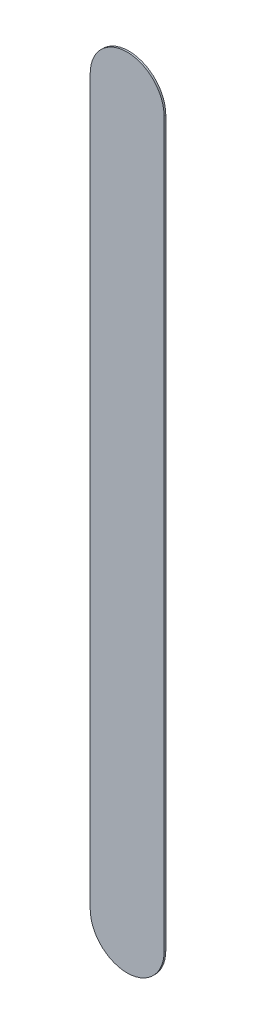
ISO-10303-21;
HEADER;
FILE_DESCRIPTION(('STEP AP214'),'2;1');
FILE_NAME('part.step','',(''),(''),'','','');
FILE_SCHEMA(('AUTOMOTIVE_DESIGN { 1 0 10303 214 1 1 1 1 }'));
ENDSEC;
DATA;
#1=APPLICATION_CONTEXT('core data for automotive mechanical design processes');
#2=APPLICATION_PROTOCOL_DEFINITION('international standard','automotive_design',2000,#1);
#3=PRODUCT_CONTEXT('',#1,'mechanical');
#4=PRODUCT('Part','Part','',(#3));
#5=PRODUCT_RELATED_PRODUCT_CATEGORY('part','',(#4));
#6=PRODUCT_DEFINITION_FORMATION('','',#4);
#7=PRODUCT_DEFINITION_CONTEXT('part definition',#1,'design');
#8=PRODUCT_DEFINITION('design','',#6,#7);
#9=PRODUCT_DEFINITION_SHAPE('','',#8);
#10=(LENGTH_UNIT() NAMED_UNIT(*) SI_UNIT(.MILLI.,.METRE.));
#11=(NAMED_UNIT(*) PLANE_ANGLE_UNIT() SI_UNIT($,.RADIAN.));
#12=(NAMED_UNIT(*) SI_UNIT($,.STERADIAN.) SOLID_ANGLE_UNIT());
#13=UNCERTAINTY_MEASURE_WITH_UNIT(LENGTH_MEASURE(1.E-05),#10,'distance_accuracy_value','');
#14=(GEOMETRIC_REPRESENTATION_CONTEXT(3) GLOBAL_UNCERTAINTY_ASSIGNED_CONTEXT((#13)) GLOBAL_UNIT_ASSIGNED_CONTEXT((#10,
#11,#12)) REPRESENTATION_CONTEXT('',''));
#15=CARTESIAN_POINT('',(0.,0.,0.));
#16=DIRECTION('',(0.,0.,1.));
#17=DIRECTION('',(1.,0.,0.));
#18=AXIS2_PLACEMENT_3D('',#15,#16,#17);
#19=CARTESIAN_POINT('',(126.758,-124.79,0.));
#20=DIRECTION('',(0.,0.,1.));
#21=DIRECTION('',(1.,0.,0.));
#22=AXIS2_PLACEMENT_3D('',#19,#20,#21);
#23=PLANE('',#22);
#24=DIRECTION('',(0.,-1.,0.));
#25=VECTOR('',#24,1.);
#26=CARTESIAN_POINT('',(126.758,-124.79,0.));
#27=LINE('',#26,#25);
#28=CARTESIAN_POINT('',(126.758,-124.79,0.));
#29=VERTEX_POINT('',#28);
#30=CARTESIAN_POINT('',(126.758,-139.488,0.));
#31=VERTEX_POINT('',#30);
#32=EDGE_CURVE('E81',#29,#31,#27,.T.);
#33=ORIENTED_EDGE('',*,*,#32,.T.);
#34=CARTESIAN_POINT('',(127.508,-139.488,0.));
#35=DIRECTION('',(0.,0.,1.));
#36=DIRECTION('',(-1.,0.,0.));
#37=AXIS2_PLACEMENT_3D('',#34,#35,#36);
#38=CIRCLE('',#37,0.75);
#39=CARTESIAN_POINT('',(128.258,-139.488,0.));
#40=VERTEX_POINT('',#39);
#41=EDGE_CURVE('E100',#31,#40,#38,.T.);
#42=ORIENTED_EDGE('',*,*,#41,.T.);
#43=DIRECTION('',(0.,1.,0.));
#44=VECTOR('',#43,1.);
#45=CARTESIAN_POINT('',(128.258,-139.488,0.));
#46=LINE('',#45,#44);
#47=CARTESIAN_POINT('',(128.258,-124.79,0.));
#48=VERTEX_POINT('',#47);
#49=EDGE_CURVE('E74',#40,#48,#46,.T.);
#50=ORIENTED_EDGE('',*,*,#49,.T.);
#51=CARTESIAN_POINT('',(127.508,-124.79,0.));
#52=DIRECTION('',(0.,0.,1.));
#53=DIRECTION('',(1.,0.,0.));
#54=AXIS2_PLACEMENT_3D('',#51,#52,#53);
#55=CIRCLE('',#54,0.75);
#56=EDGE_CURVE('E11',#48,#29,#55,.T.);
#57=ORIENTED_EDGE('',*,*,#56,.T.);
#58=EDGE_LOOP('',(#33,#42,#50,#57));
#59=FACE_BOUND('',#58,.T.);
#60=ADVANCED_FACE('F17',(#59),#23,.T.);
#61=CARTESIAN_POINT('',(126.758,-124.79,-0.035));
#62=DIRECTION('',(0.,0.,1.));
#63=DIRECTION('',(1.,0.,0.));
#64=AXIS2_PLACEMENT_3D('',#61,#62,#63);
#65=PLANE('',#64);
#66=CARTESIAN_POINT('',(127.508,-124.79,-0.035));
#67=DIRECTION('',(0.,0.,1.));
#68=DIRECTION('',(1.,0.,0.));
#69=AXIS2_PLACEMENT_3D('',#66,#67,#68);
#70=CIRCLE('',#69,0.75);
#71=CARTESIAN_POINT('',(128.258,-124.79,-0.035));
#72=VERTEX_POINT('',#71);
#73=CARTESIAN_POINT('',(126.758,-124.79,-0.035));
#74=VERTEX_POINT('',#73);
#75=EDGE_CURVE('E25',#72,#74,#70,.T.);
#76=ORIENTED_EDGE('',*,*,#75,.F.);
#77=DIRECTION('',(0.,1.,0.));
#78=VECTOR('',#77,1.);
#79=CARTESIAN_POINT('',(128.258,-139.488,-0.035));
#80=LINE('',#79,#78);
#81=CARTESIAN_POINT('',(128.258,-139.488,-0.035));
#82=VERTEX_POINT('',#81);
#83=EDGE_CURVE('E97',#82,#72,#80,.T.);
#84=ORIENTED_EDGE('',*,*,#83,.F.);
#85=CARTESIAN_POINT('',(127.508,-139.488,-0.035));
#86=DIRECTION('',(0.,0.,1.));
#87=DIRECTION('',(-1.,0.,0.));
#88=AXIS2_PLACEMENT_3D('',#85,#86,#87);
#89=CIRCLE('',#88,0.75);
#90=CARTESIAN_POINT('',(126.758,-139.488,-0.035));
#91=VERTEX_POINT('',#90);
#92=EDGE_CURVE('E83',#91,#82,#89,.T.);
#93=ORIENTED_EDGE('',*,*,#92,.F.);
#94=DIRECTION('',(0.,-1.,0.));
#95=VECTOR('',#94,1.);
#96=CARTESIAN_POINT('',(126.758,-124.79,-0.035));
#97=LINE('',#96,#95);
#98=EDGE_CURVE('E79',#74,#91,#97,.T.);
#99=ORIENTED_EDGE('',*,*,#98,.F.);
#100=EDGE_LOOP('',(#76,#84,#93,#99));
#101=FACE_BOUND('',#100,.T.);
#102=ADVANCED_FACE('F85',(#101),#65,.F.);
#103=CARTESIAN_POINT('',(127.508,-124.79,-0.035));
#104=DIRECTION('',(0.,0.,-1.));
#105=DIRECTION('',(1.,0.,0.));
#106=AXIS2_PLACEMENT_3D('',#103,#104,#105);
#107=CYLINDRICAL_SURFACE('',#106,0.75);
#108=ORIENTED_EDGE('',*,*,#75,.T.);
#109=DIRECTION('',(0.,0.,1.));
#110=VECTOR('',#109,1.);
#111=CARTESIAN_POINT('',(126.758,-124.79,-0.035));
#112=LINE('',#111,#110);
#113=EDGE_CURVE('E68',#74,#29,#112,.T.);
#114=ORIENTED_EDGE('',*,*,#113,.T.);
#115=ORIENTED_EDGE('',*,*,#56,.F.);
#116=DIRECTION('',(0.,0.,1.));
#117=VECTOR('',#116,1.);
#118=CARTESIAN_POINT('',(128.258,-124.79,-0.035));
#119=LINE('',#118,#117);
#120=EDGE_CURVE('E71',#72,#48,#119,.T.);
#121=ORIENTED_EDGE('',*,*,#120,.F.);
#122=EDGE_LOOP('',(#108,#114,#115,#121));
#123=FACE_BOUND('',#122,.T.);
#124=ADVANCED_FACE('F67',(#123),#107,.T.);
#125=CARTESIAN_POINT('',(128.258,-139.488,-0.035));
#126=DIRECTION('',(-1.,0.,0.));
#127=DIRECTION('',(0.,0.,1.));
#128=AXIS2_PLACEMENT_3D('',#125,#126,#127);
#129=PLANE('',#128);
#130=ORIENTED_EDGE('',*,*,#83,.T.);
#131=ORIENTED_EDGE('',*,*,#120,.T.);
#132=ORIENTED_EDGE('',*,*,#49,.F.);
#133=DIRECTION('',(0.,0.,1.));
#134=VECTOR('',#133,1.);
#135=CARTESIAN_POINT('',(128.258,-139.488,-0.035));
#136=LINE('',#135,#134);
#137=EDGE_CURVE('E107',#82,#40,#136,.T.);
#138=ORIENTED_EDGE('',*,*,#137,.F.);
#139=EDGE_LOOP('',(#130,#131,#132,#138));
#140=FACE_BOUND('',#139,.T.);
#141=ADVANCED_FACE('F122',(#140),#129,.F.);
#142=CARTESIAN_POINT('',(127.508,-139.488,-0.035));
#143=DIRECTION('',(0.,0.,-1.));
#144=DIRECTION('',(-1.,0.,0.));
#145=AXIS2_PLACEMENT_3D('',#142,#143,#144);
#146=CYLINDRICAL_SURFACE('',#145,0.75);
#147=ORIENTED_EDGE('',*,*,#92,.T.);
#148=ORIENTED_EDGE('',*,*,#137,.T.);
#149=ORIENTED_EDGE('',*,*,#41,.F.);
#150=DIRECTION('',(0.,0.,1.));
#151=VECTOR('',#150,1.);
#152=CARTESIAN_POINT('',(126.758,-139.488,-0.035));
#153=LINE('',#152,#151);
#154=EDGE_CURVE('E89',#91,#31,#153,.T.);
#155=ORIENTED_EDGE('',*,*,#154,.F.);
#156=EDGE_LOOP('',(#147,#148,#149,#155));
#157=FACE_BOUND('',#156,.T.);
#158=ADVANCED_FACE('F120',(#157),#146,.T.);
#159=CARTESIAN_POINT('',(126.758,-124.79,-0.035));
#160=DIRECTION('',(1.,0.,0.));
#161=DIRECTION('',(0.,1.,0.));
#162=AXIS2_PLACEMENT_3D('',#159,#160,#161);
#163=PLANE('',#162);
#164=ORIENTED_EDGE('',*,*,#98,.T.);
#165=ORIENTED_EDGE('',*,*,#154,.T.);
#166=ORIENTED_EDGE('',*,*,#32,.F.);
#167=ORIENTED_EDGE('',*,*,#113,.F.);
#168=EDGE_LOOP('',(#164,#165,#166,#167));
#169=FACE_BOUND('',#168,.T.);
#170=ADVANCED_FACE('F77',(#169),#163,.F.);
#171=CLOSED_SHELL('',(#60,#102,#124,#141,#158,#170));
#172=MANIFOLD_SOLID_BREP('B1',#171);
#173=ADVANCED_BREP_SHAPE_REPRESENTATION('',(#18,#172),#14);
#174=SHAPE_DEFINITION_REPRESENTATION(#9,#173);
ENDSEC;
END-ISO-10303-21;
